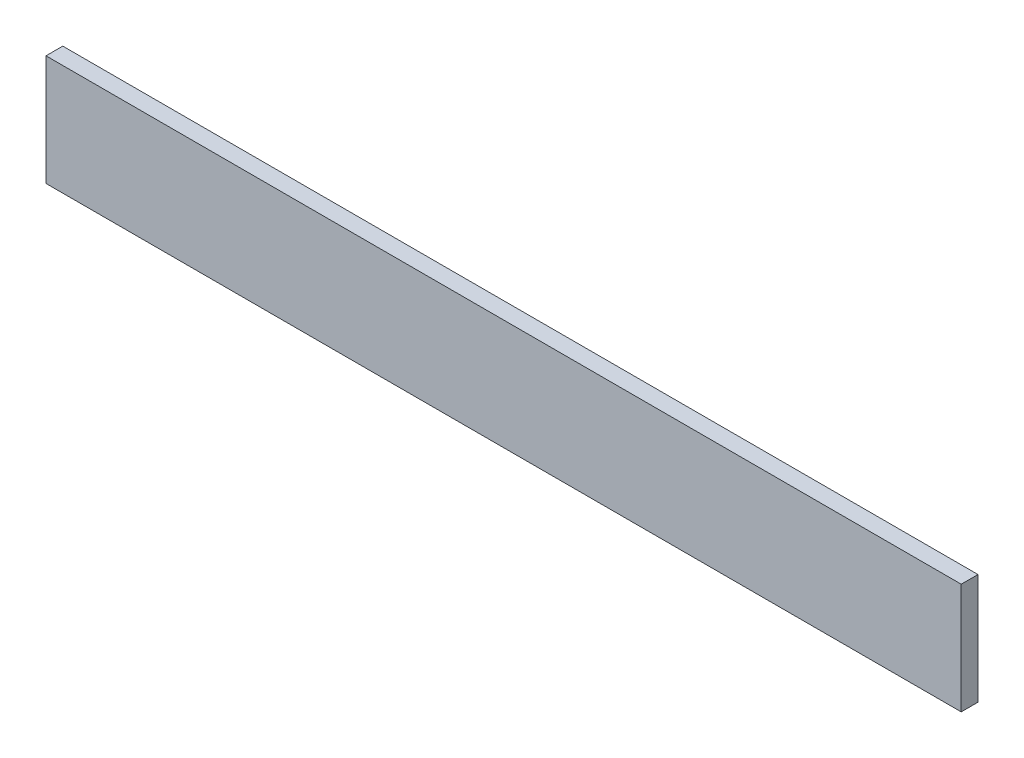
ISO-10303-21;
HEADER;
FILE_DESCRIPTION(('STEP AP214'),'2;1');
FILE_NAME('part.step','',(''),(''),'','','');
FILE_SCHEMA(('AUTOMOTIVE_DESIGN { 1 0 10303 214 1 1 1 1 }'));
ENDSEC;
DATA;
#1=APPLICATION_CONTEXT('core data for automotive mechanical design processes');
#2=APPLICATION_PROTOCOL_DEFINITION('international standard','automotive_design',2000,#1);
#3=PRODUCT_CONTEXT('',#1,'mechanical');
#4=PRODUCT('Part','Part','',(#3));
#5=PRODUCT_RELATED_PRODUCT_CATEGORY('part','',(#4));
#6=PRODUCT_DEFINITION_FORMATION('','',#4);
#7=PRODUCT_DEFINITION_CONTEXT('part definition',#1,'design');
#8=PRODUCT_DEFINITION('design','',#6,#7);
#9=PRODUCT_DEFINITION_SHAPE('','',#8);
#10=(LENGTH_UNIT() NAMED_UNIT(*) SI_UNIT(.MILLI.,.METRE.));
#11=(NAMED_UNIT(*) PLANE_ANGLE_UNIT() SI_UNIT($,.RADIAN.));
#12=(NAMED_UNIT(*) SI_UNIT($,.STERADIAN.) SOLID_ANGLE_UNIT());
#13=UNCERTAINTY_MEASURE_WITH_UNIT(LENGTH_MEASURE(1.E-05),#10,'distance_accuracy_value','');
#14=(GEOMETRIC_REPRESENTATION_CONTEXT(3) GLOBAL_UNCERTAINTY_ASSIGNED_CONTEXT((#13)) GLOBAL_UNIT_ASSIGNED_CONTEXT((#10,
#11,#12)) REPRESENTATION_CONTEXT('',''));
#15=CARTESIAN_POINT('',(0.,0.,0.));
#16=DIRECTION('',(0.,0.,1.));
#17=DIRECTION('',(1.,0.,0.));
#18=AXIS2_PLACEMENT_3D('',#15,#16,#17);
#19=CARTESIAN_POINT('',(600.,72.4999999999983,22.));
#20=DIRECTION('',(-1.,0.,0.));
#21=DIRECTION('',(0.,0.,1.));
#22=AXIS2_PLACEMENT_3D('',#19,#20,#21);
#23=PLANE('',#22);
#24=DIRECTION('',(0.,1.,0.));
#25=VECTOR('',#24,1.);
#26=CARTESIAN_POINT('',(600.,72.4999999999983,0.));
#27=LINE('',#26,#25);
#28=CARTESIAN_POINT('',(600.,-72.4999999999983,0.));
#29=VERTEX_POINT('',#28);
#30=CARTESIAN_POINT('',(600.,72.4999999999983,0.));
#31=VERTEX_POINT('',#30);
#32=EDGE_CURVE('E95',#29,#31,#27,.T.);
#33=ORIENTED_EDGE('',*,*,#32,.T.);
#34=DIRECTION('',(0.,0.,-1.));
#35=VECTOR('',#34,1.);
#36=CARTESIAN_POINT('',(600.,72.4999999999983,22.));
#37=LINE('',#36,#35);
#38=CARTESIAN_POINT('',(600.,72.4999999999983,22.));
#39=VERTEX_POINT('',#38);
#40=EDGE_CURVE('E11',#39,#31,#37,.T.);
#41=ORIENTED_EDGE('',*,*,#40,.F.);
#42=DIRECTION('',(0.,1.,0.));
#43=VECTOR('',#42,1.);
#44=CARTESIAN_POINT('',(600.,72.4999999999983,22.));
#45=LINE('',#44,#43);
#46=CARTESIAN_POINT('',(600.,-72.4999999999983,22.));
#47=VERTEX_POINT('',#46);
#48=EDGE_CURVE('E83',#47,#39,#45,.T.);
#49=ORIENTED_EDGE('',*,*,#48,.F.);
#50=DIRECTION('',(0.,0.,-1.));
#51=VECTOR('',#50,1.);
#52=CARTESIAN_POINT('',(600.,-72.4999999999983,22.));
#53=LINE('',#52,#51);
#54=EDGE_CURVE('E91',#47,#29,#53,.T.);
#55=ORIENTED_EDGE('',*,*,#54,.T.);
#56=EDGE_LOOP('',(#33,#41,#49,#55));
#57=FACE_BOUND('',#56,.T.);
#58=ADVANCED_FACE('F32',(#57),#23,.F.);
#59=CARTESIAN_POINT('',(600.,72.4999999999983,22.));
#60=DIRECTION('',(0.,-1.,0.));
#61=DIRECTION('',(1.,0.,0.));
#62=AXIS2_PLACEMENT_3D('',#59,#60,#61);
#63=PLANE('',#62);
#64=DIRECTION('',(-1.,0.,0.));
#65=VECTOR('',#64,1.);
#66=CARTESIAN_POINT('',(600.,72.4999999999983,0.));
#67=LINE('',#66,#65);
#68=CARTESIAN_POINT('',(-600.000000000003,72.4999999999981,0.));
#69=VERTEX_POINT('',#68);
#70=EDGE_CURVE('E87',#31,#69,#67,.T.);
#71=ORIENTED_EDGE('',*,*,#70,.T.);
#72=DIRECTION('',(0.,0.,-1.));
#73=VECTOR('',#72,1.);
#74=CARTESIAN_POINT('',(-600.000000000003,72.4999999999981,22.));
#75=LINE('',#74,#73);
#76=CARTESIAN_POINT('',(-600.000000000003,72.4999999999981,22.));
#77=VERTEX_POINT('',#76);
#78=EDGE_CURVE('E40',#77,#69,#75,.T.);
#79=ORIENTED_EDGE('',*,*,#78,.F.);
#80=DIRECTION('',(-1.,0.,0.));
#81=VECTOR('',#80,1.);
#82=CARTESIAN_POINT('',(600.,72.4999999999983,22.));
#83=LINE('',#82,#81);
#84=EDGE_CURVE('E78',#39,#77,#83,.T.);
#85=ORIENTED_EDGE('',*,*,#84,.F.);
#86=ORIENTED_EDGE('',*,*,#40,.T.);
#87=EDGE_LOOP('',(#71,#79,#85,#86));
#88=FACE_BOUND('',#87,.T.);
#89=ADVANCED_FACE('F86',(#88),#63,.F.);
#90=CARTESIAN_POINT('',(-600.000000000003,72.4999999999981,22.));
#91=DIRECTION('',(1.,0.,0.));
#92=DIRECTION('',(0.,0.,-1.));
#93=AXIS2_PLACEMENT_3D('',#90,#91,#92);
#94=PLANE('',#93);
#95=DIRECTION('',(0.,-1.,0.));
#96=VECTOR('',#95,1.);
#97=CARTESIAN_POINT('',(-600.000000000003,72.4999999999981,0.));
#98=LINE('',#97,#96);
#99=CARTESIAN_POINT('',(-600.000000000003,-72.4999999999981,0.));
#100=VERTEX_POINT('',#99);
#101=EDGE_CURVE('E65',#69,#100,#98,.T.);
#102=ORIENTED_EDGE('',*,*,#101,.T.);
#103=DIRECTION('',(0.,0.,-1.));
#104=VECTOR('',#103,1.);
#105=CARTESIAN_POINT('',(-600.000000000003,-72.4999999999981,22.));
#106=LINE('',#105,#104);
#107=CARTESIAN_POINT('',(-600.000000000003,-72.4999999999981,22.));
#108=VERTEX_POINT('',#107);
#109=EDGE_CURVE('E88',#108,#100,#106,.T.);
#110=ORIENTED_EDGE('',*,*,#109,.F.);
#111=DIRECTION('',(0.,-1.,0.));
#112=VECTOR('',#111,1.);
#113=CARTESIAN_POINT('',(-600.000000000003,72.4999999999981,22.));
#114=LINE('',#113,#112);
#115=EDGE_CURVE('E81',#77,#108,#114,.T.);
#116=ORIENTED_EDGE('',*,*,#115,.F.);
#117=ORIENTED_EDGE('',*,*,#78,.T.);
#118=EDGE_LOOP('',(#102,#110,#116,#117));
#119=FACE_BOUND('',#118,.T.);
#120=ADVANCED_FACE('F89',(#119),#94,.F.);
#121=CARTESIAN_POINT('',(600.,-72.4999999999983,22.));
#122=DIRECTION('',(0.,1.,0.));
#123=DIRECTION('',(-1.,0.,0.));
#124=AXIS2_PLACEMENT_3D('',#121,#122,#123);
#125=PLANE('',#124);
#126=DIRECTION('',(1.,0.,0.));
#127=VECTOR('',#126,1.);
#128=CARTESIAN_POINT('',(600.,-72.4999999999983,0.));
#129=LINE('',#128,#127);
#130=EDGE_CURVE('E71',#100,#29,#129,.T.);
#131=ORIENTED_EDGE('',*,*,#130,.T.);
#132=ORIENTED_EDGE('',*,*,#54,.F.);
#133=DIRECTION('',(1.,0.,0.));
#134=VECTOR('',#133,1.);
#135=CARTESIAN_POINT('',(600.,-72.4999999999983,22.));
#136=LINE('',#135,#134);
#137=EDGE_CURVE('E48',#108,#47,#136,.T.);
#138=ORIENTED_EDGE('',*,*,#137,.F.);
#139=ORIENTED_EDGE('',*,*,#109,.T.);
#140=EDGE_LOOP('',(#131,#132,#138,#139));
#141=FACE_BOUND('',#140,.T.);
#142=ADVANCED_FACE('F102',(#141),#125,.F.);
#143=CARTESIAN_POINT('',(600.,-72.4999999999983,22.));
#144=DIRECTION('',(0.,0.,-1.));
#145=DIRECTION('',(-1.,0.,0.));
#146=AXIS2_PLACEMENT_3D('',#143,#144,#145);
#147=PLANE('',#146);
#148=ORIENTED_EDGE('',*,*,#48,.T.);
#149=ORIENTED_EDGE('',*,*,#84,.T.);
#150=ORIENTED_EDGE('',*,*,#115,.T.);
#151=ORIENTED_EDGE('',*,*,#137,.T.);
#152=EDGE_LOOP('',(#148,#149,#150,#151));
#153=FACE_BOUND('',#152,.T.);
#154=ADVANCED_FACE('F79',(#153),#147,.F.);
#155=CARTESIAN_POINT('',(600.,-72.4999999999983,0.));
#156=DIRECTION('',(0.,0.,-1.));
#157=DIRECTION('',(-1.,0.,0.));
#158=AXIS2_PLACEMENT_3D('',#155,#156,#157);
#159=PLANE('',#158);
#160=ORIENTED_EDGE('',*,*,#32,.F.);
#161=ORIENTED_EDGE('',*,*,#130,.F.);
#162=ORIENTED_EDGE('',*,*,#101,.F.);
#163=ORIENTED_EDGE('',*,*,#70,.F.);
#164=EDGE_LOOP('',(#160,#161,#162,#163));
#165=FACE_BOUND('',#164,.T.);
#166=ADVANCED_FACE('F105',(#165),#159,.T.);
#167=CLOSED_SHELL('',(#58,#89,#120,#142,#154,#166));
#168=MANIFOLD_SOLID_BREP('B2',#167);
#169=ADVANCED_BREP_SHAPE_REPRESENTATION('',(#18,#168),#14);
#170=SHAPE_DEFINITION_REPRESENTATION(#9,#169);
ENDSEC;
END-ISO-10303-21;
